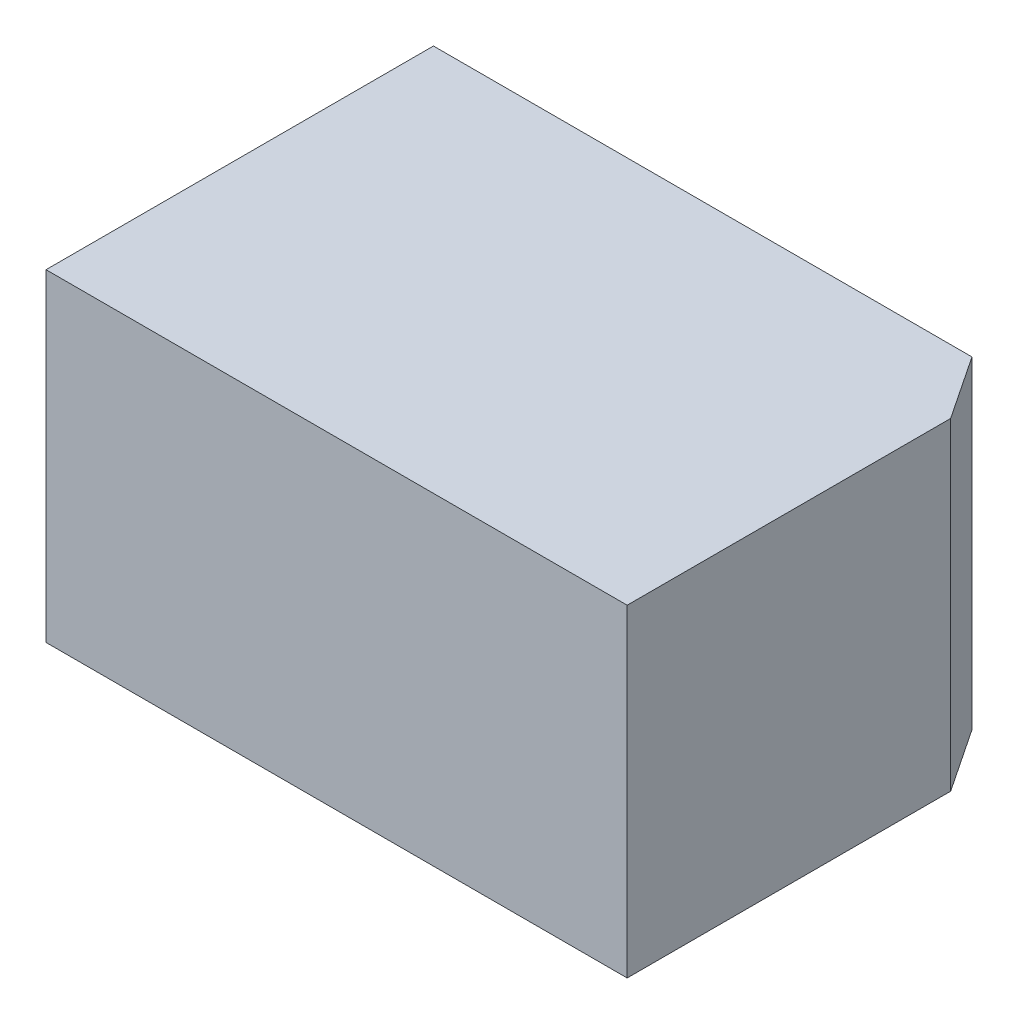
ISO-10303-21;
HEADER;
FILE_DESCRIPTION(('STEP AP214'),'2;1');
FILE_NAME('part.step','',(''),(''),'','','');
FILE_SCHEMA(('AUTOMOTIVE_DESIGN { 1 0 10303 214 1 1 1 1 }'));
ENDSEC;
DATA;
#1=APPLICATION_CONTEXT('core data for automotive mechanical design processes');
#2=APPLICATION_PROTOCOL_DEFINITION('international standard','automotive_design',2000,#1);
#3=PRODUCT_CONTEXT('',#1,'mechanical');
#4=PRODUCT('Part','Part','',(#3));
#5=PRODUCT_RELATED_PRODUCT_CATEGORY('part','',(#4));
#6=PRODUCT_DEFINITION_FORMATION('','',#4);
#7=PRODUCT_DEFINITION_CONTEXT('part definition',#1,'design');
#8=PRODUCT_DEFINITION('design','',#6,#7);
#9=PRODUCT_DEFINITION_SHAPE('','',#8);
#10=(LENGTH_UNIT() NAMED_UNIT(*) SI_UNIT(.MILLI.,.METRE.));
#11=(NAMED_UNIT(*) PLANE_ANGLE_UNIT() SI_UNIT($,.RADIAN.));
#12=(NAMED_UNIT(*) SI_UNIT($,.STERADIAN.) SOLID_ANGLE_UNIT());
#13=UNCERTAINTY_MEASURE_WITH_UNIT(LENGTH_MEASURE(1.E-05),#10,'distance_accuracy_value','');
#14=(GEOMETRIC_REPRESENTATION_CONTEXT(3) GLOBAL_UNCERTAINTY_ASSIGNED_CONTEXT((#13)) GLOBAL_UNIT_ASSIGNED_CONTEXT((#10,
#11,#12)) REPRESENTATION_CONTEXT('',''));
#15=CARTESIAN_POINT('',(0.,0.,0.));
#16=DIRECTION('',(0.,0.,1.));
#17=DIRECTION('',(1.,0.,0.));
#18=AXIS2_PLACEMENT_3D('',#15,#16,#17);
#19=CARTESIAN_POINT('',(-4.5,5.,-3.));
#20=DIRECTION('',(1.,0.,0.));
#21=DIRECTION('',(0.,0.,-1.));
#22=AXIS2_PLACEMENT_3D('',#19,#20,#21);
#23=PLANE('',#22);
#24=DIRECTION('',(0.,0.,1.));
#25=VECTOR('',#24,1.);
#26=CARTESIAN_POINT('',(-4.5,0.,-3.));
#27=LINE('',#26,#25);
#28=CARTESIAN_POINT('',(-4.5,0.,-3.));
#29=VERTEX_POINT('',#28);
#30=CARTESIAN_POINT('',(-4.5,0.,3.));
#31=VERTEX_POINT('',#30);
#32=EDGE_CURVE('E109',#29,#31,#27,.T.);
#33=ORIENTED_EDGE('',*,*,#32,.T.);
#34=DIRECTION('',(0.,-1.,0.));
#35=VECTOR('',#34,1.);
#36=CARTESIAN_POINT('',(-4.5,5.,3.));
#37=LINE('',#36,#35);
#38=CARTESIAN_POINT('',(-4.5,5.,3.));
#39=VERTEX_POINT('',#38);
#40=EDGE_CURVE('E11',#39,#31,#37,.T.);
#41=ORIENTED_EDGE('',*,*,#40,.F.);
#42=DIRECTION('',(0.,0.,1.));
#43=VECTOR('',#42,1.);
#44=CARTESIAN_POINT('',(-4.5,5.,-3.));
#45=LINE('',#44,#43);
#46=CARTESIAN_POINT('',(-4.5,5.,-3.));
#47=VERTEX_POINT('',#46);
#48=EDGE_CURVE('E105',#47,#39,#45,.T.);
#49=ORIENTED_EDGE('',*,*,#48,.F.);
#50=DIRECTION('',(0.,-1.,0.));
#51=VECTOR('',#50,1.);
#52=CARTESIAN_POINT('',(-4.5,5.,-3.));
#53=LINE('',#52,#51);
#54=EDGE_CURVE('E103',#47,#29,#53,.T.);
#55=ORIENTED_EDGE('',*,*,#54,.T.);
#56=EDGE_LOOP('',(#33,#41,#49,#55));
#57=FACE_BOUND('',#56,.T.);
#58=ADVANCED_FACE('F33',(#57),#23,.F.);
#59=CARTESIAN_POINT('',(4.5,5.,3.));
#60=DIRECTION('',(0.,0.,-1.));
#61=DIRECTION('',(-1.,0.,0.));
#62=AXIS2_PLACEMENT_3D('',#59,#60,#61);
#63=PLANE('',#62);
#64=DIRECTION('',(1.,0.,0.));
#65=VECTOR('',#64,1.);
#66=CARTESIAN_POINT('',(4.5,0.,3.));
#67=LINE('',#66,#65);
#68=CARTESIAN_POINT('',(4.5,0.,3.));
#69=VERTEX_POINT('',#68);
#70=EDGE_CURVE('E112',#31,#69,#67,.T.);
#71=ORIENTED_EDGE('',*,*,#70,.T.);
#72=DIRECTION('',(0.,-1.,0.));
#73=VECTOR('',#72,1.);
#74=CARTESIAN_POINT('',(4.5,5.,3.));
#75=LINE('',#74,#73);
#76=CARTESIAN_POINT('',(4.5,5.,3.));
#77=VERTEX_POINT('',#76);
#78=EDGE_CURVE('E40',#77,#69,#75,.T.);
#79=ORIENTED_EDGE('',*,*,#78,.F.);
#80=DIRECTION('',(1.,0.,0.));
#81=VECTOR('',#80,1.);
#82=CARTESIAN_POINT('',(4.5,5.,3.));
#83=LINE('',#82,#81);
#84=EDGE_CURVE('E79',#39,#77,#83,.T.);
#85=ORIENTED_EDGE('',*,*,#84,.F.);
#86=ORIENTED_EDGE('',*,*,#40,.T.);
#87=EDGE_LOOP('',(#71,#79,#85,#86));
#88=FACE_BOUND('',#87,.T.);
#89=ADVANCED_FACE('F149',(#88),#63,.F.);
#90=CARTESIAN_POINT('',(4.5,5.,-3.));
#91=DIRECTION('',(-1.,0.,0.));
#92=DIRECTION('',(0.,0.,1.));
#93=AXIS2_PLACEMENT_3D('',#90,#91,#92);
#94=PLANE('',#93);
#95=DIRECTION('',(0.,0.,-1.));
#96=VECTOR('',#95,1.);
#97=CARTESIAN_POINT('',(4.5,0.,-3.));
#98=LINE('',#97,#96);
#99=CARTESIAN_POINT('',(4.5,0.,-2.00986014973797));
#100=VERTEX_POINT('',#99);
#101=EDGE_CURVE('E99',#69,#100,#98,.T.);
#102=ORIENTED_EDGE('',*,*,#101,.T.);
#103=DIRECTION('',(0.,-1.,0.));
#104=VECTOR('',#103,1.);
#105=CARTESIAN_POINT('',(4.5,5.,-2.00986014973797));
#106=LINE('',#105,#104);
#107=CARTESIAN_POINT('',(4.5,5.,-2.00986014973797));
#108=VERTEX_POINT('',#107);
#109=EDGE_CURVE('E47',#108,#100,#106,.T.);
#110=ORIENTED_EDGE('',*,*,#109,.F.);
#111=DIRECTION('',(0.,0.,-1.));
#112=VECTOR('',#111,1.);
#113=CARTESIAN_POINT('',(4.5,5.,-3.));
#114=LINE('',#113,#112);
#115=EDGE_CURVE('E97',#77,#108,#114,.T.);
#116=ORIENTED_EDGE('',*,*,#115,.F.);
#117=ORIENTED_EDGE('',*,*,#78,.T.);
#118=EDGE_LOOP('',(#102,#110,#116,#117));
#119=FACE_BOUND('',#118,.T.);
#120=ADVANCED_FACE('F95',(#119),#94,.F.);
#121=CARTESIAN_POINT('',(4.5,5.,-3.));
#122=DIRECTION('',(0.,0.,1.));
#123=DIRECTION('',(1.,0.,0.));
#124=AXIS2_PLACEMENT_3D('',#121,#122,#123);
#125=PLANE('',#124);
#126=DIRECTION('',(-1.,0.,0.));
#127=VECTOR('',#126,1.);
#128=CARTESIAN_POINT('',(4.5,5.,-3.));
#129=LINE('',#128,#127);
#130=CARTESIAN_POINT('',(3.83990676649198,5.,-3.));
#131=VERTEX_POINT('',#130);
#132=EDGE_CURVE('E56',#131,#47,#129,.T.);
#133=ORIENTED_EDGE('',*,*,#132,.F.);
#134=DIRECTION('',(0.,-1.,0.));
#135=VECTOR('',#134,1.);
#136=CARTESIAN_POINT('',(3.83990676649198,5.,-3.));
#137=LINE('',#136,#135);
#138=CARTESIAN_POINT('',(3.83990676649198,0.,-3.));
#139=VERTEX_POINT('',#138);
#140=EDGE_CURVE('E88',#131,#139,#137,.T.);
#141=ORIENTED_EDGE('',*,*,#140,.T.);
#142=DIRECTION('',(-1.,0.,0.));
#143=VECTOR('',#142,1.);
#144=CARTESIAN_POINT('',(4.5,0.,-3.));
#145=LINE('',#144,#143);
#146=EDGE_CURVE('E74',#139,#29,#145,.T.);
#147=ORIENTED_EDGE('',*,*,#146,.T.);
#148=ORIENTED_EDGE('',*,*,#54,.F.);
#149=EDGE_LOOP('',(#133,#141,#147,#148));
#150=FACE_BOUND('',#149,.T.);
#151=ADVANCED_FACE('F155',(#150),#125,.F.);
#152=CARTESIAN_POINT('',(0.,5.,0.));
#153=DIRECTION('',(0.,-1.,0.));
#154=DIRECTION('',(0.,0.,-1.));
#155=AXIS2_PLACEMENT_3D('',#152,#153,#154);
#156=PLANE('',#155);
#157=ORIENTED_EDGE('',*,*,#115,.T.);
#158=DIRECTION('',(-0.55470019622523,0.,-0.832050294337843));
#159=VECTOR('',#158,1.);
#160=CARTESIAN_POINT('',(3.83990676649198,5.,-3.));
#161=LINE('',#160,#159);
#162=EDGE_CURVE('E86',#108,#131,#161,.T.);
#163=ORIENTED_EDGE('',*,*,#162,.T.);
#164=ORIENTED_EDGE('',*,*,#132,.T.);
#165=ORIENTED_EDGE('',*,*,#48,.T.);
#166=ORIENTED_EDGE('',*,*,#84,.T.);
#167=EDGE_LOOP('',(#157,#163,#164,#165,#166));
#168=FACE_BOUND('',#167,.T.);
#169=ADVANCED_FACE('F101',(#168),#156,.F.);
#170=CARTESIAN_POINT('',(0.,0.,0.));
#171=DIRECTION('',(0.,-1.,0.));
#172=DIRECTION('',(0.,0.,-1.));
#173=AXIS2_PLACEMENT_3D('',#170,#171,#172);
#174=PLANE('',#173);
#175=DIRECTION('',(-0.55470019622523,0.,-0.832050294337843));
#176=VECTOR('',#175,1.);
#177=CARTESIAN_POINT('',(3.83990676649198,0.,-3.));
#178=LINE('',#177,#176);
#179=EDGE_CURVE('E90',#100,#139,#178,.T.);
#180=ORIENTED_EDGE('',*,*,#179,.F.);
#181=ORIENTED_EDGE('',*,*,#101,.F.);
#182=ORIENTED_EDGE('',*,*,#70,.F.);
#183=ORIENTED_EDGE('',*,*,#32,.F.);
#184=ORIENTED_EDGE('',*,*,#146,.F.);
#185=EDGE_LOOP('',(#180,#181,#182,#183,#184));
#186=FACE_BOUND('',#185,.T.);
#187=CARTESIAN_POINT('',(1.5,0.,0.));
#188=DIRECTION('',(0.,-1.,0.));
#189=DIRECTION('',(0.,0.,-1.));
#190=AXIS2_PLACEMENT_3D('',#187,#188,#189);
#191=CIRCLE('',#190,0.795000000000002);
#192=CARTESIAN_POINT('',(1.5,0.,-0.795000000000002));
#193=VERTEX_POINT('',#192);
#194=EDGE_CURVE('E123',#193,#193,#191,.T.);
#195=ORIENTED_EDGE('',*,*,#194,.F.);
#196=EDGE_LOOP('',(#195));
#197=FACE_BOUND('',#196,.T.);
#198=CARTESIAN_POINT('',(-3.25,0.,1.875));
#199=DIRECTION('',(0.,-1.,0.));
#200=DIRECTION('',(0.,0.,-1.));
#201=AXIS2_PLACEMENT_3D('',#198,#199,#200);
#202=CIRCLE('',#201,0.795000000000001);
#203=CARTESIAN_POINT('',(-3.25,0.,1.08));
#204=VERTEX_POINT('',#203);
#205=EDGE_CURVE('E128',#204,#204,#202,.T.);
#206=ORIENTED_EDGE('',*,*,#205,.F.);
#207=EDGE_LOOP('',(#206));
#208=FACE_BOUND('',#207,.T.);
#209=CARTESIAN_POINT('',(-3.25,0.,-1.875));
#210=DIRECTION('',(0.,-1.,0.));
#211=DIRECTION('',(0.,0.,-1.));
#212=AXIS2_PLACEMENT_3D('',#209,#210,#211);
#213=CIRCLE('',#212,0.795000000000001);
#214=CARTESIAN_POINT('',(-3.25,0.,-2.67));
#215=VERTEX_POINT('',#214);
#216=EDGE_CURVE('E134',#215,#215,#213,.T.);
#217=ORIENTED_EDGE('',*,*,#216,.F.);
#218=EDGE_LOOP('',(#217));
#219=FACE_BOUND('',#218,.T.);
#220=CARTESIAN_POINT('',(-1.5,0.,0.));
#221=DIRECTION('',(0.,-1.,0.));
#222=DIRECTION('',(0.,0.,-1.));
#223=AXIS2_PLACEMENT_3D('',#220,#221,#222);
#224=CIRCLE('',#223,1.25);
#225=CARTESIAN_POINT('',(-1.5,0.,-1.25));
#226=VERTEX_POINT('',#225);
#227=EDGE_CURVE('E140',#226,#226,#224,.T.);
#228=ORIENTED_EDGE('',*,*,#227,.F.);
#229=EDGE_LOOP('',(#228));
#230=FACE_BOUND('',#229,.T.);
#231=ADVANCED_FACE('F118',(#186,#197,#208,#219,#230),#174,.T.);
#232=CARTESIAN_POINT('',(-1.5,4.,0.));
#233=DIRECTION('',(0.,-1.,0.));
#234=DIRECTION('',(0.,0.,-1.));
#235=AXIS2_PLACEMENT_3D('',#232,#233,#234);
#236=CYLINDRICAL_SURFACE('',#235,1.25);
#237=CARTESIAN_POINT('',(-1.5,4.,0.));
#238=DIRECTION('',(0.,-1.,0.));
#239=DIRECTION('',(0.,0.,-1.));
#240=AXIS2_PLACEMENT_3D('',#237,#238,#239);
#241=CIRCLE('',#240,1.25);
#242=CARTESIAN_POINT('',(-1.5,4.,-1.25));
#243=VERTEX_POINT('',#242);
#244=EDGE_CURVE('E113',#243,#243,#241,.T.);
#245=ORIENTED_EDGE('',*,*,#244,.F.);
#246=EDGE_LOOP('',(#245));
#247=FACE_BOUND('',#246,.T.);
#248=ORIENTED_EDGE('',*,*,#227,.T.);
#249=EDGE_LOOP('',(#248));
#250=FACE_BOUND('',#249,.T.);
#251=ADVANCED_FACE('F162',(#247,#250),#236,.F.);
#252=CARTESIAN_POINT('',(-1.5,4.,0.));
#253=DIRECTION('',(0.,-1.,0.));
#254=DIRECTION('',(0.,0.,-1.));
#255=AXIS2_PLACEMENT_3D('',#252,#253,#254);
#256=PLANE('',#255);
#257=ORIENTED_EDGE('',*,*,#244,.T.);
#258=EDGE_LOOP('',(#257));
#259=FACE_BOUND('',#258,.T.);
#260=ADVANCED_FACE('F167',(#259),#256,.T.);
#261=CARTESIAN_POINT('',(-3.25,1.,-1.875));
#262=DIRECTION('',(0.,-1.,0.));
#263=DIRECTION('',(0.,0.,-1.));
#264=AXIS2_PLACEMENT_3D('',#261,#262,#263);
#265=CYLINDRICAL_SURFACE('',#264,0.795000000000001);
#266=CARTESIAN_POINT('',(-3.25,1.,-1.875));
#267=DIRECTION('',(0.,-1.,0.));
#268=DIRECTION('',(0.,0.,-1.));
#269=AXIS2_PLACEMENT_3D('',#266,#267,#268);
#270=CIRCLE('',#269,0.795000000000001);
#271=CARTESIAN_POINT('',(-3.25,1.,-2.67));
#272=VERTEX_POINT('',#271);
#273=EDGE_CURVE('E137',#272,#272,#270,.T.);
#274=ORIENTED_EDGE('',*,*,#273,.F.);
#275=EDGE_LOOP('',(#274));
#276=FACE_BOUND('',#275,.T.);
#277=ORIENTED_EDGE('',*,*,#216,.T.);
#278=EDGE_LOOP('',(#277));
#279=FACE_BOUND('',#278,.T.);
#280=ADVANCED_FACE('F171',(#276,#279),#265,.F.);
#281=CARTESIAN_POINT('',(-3.25,1.,-1.875));
#282=DIRECTION('',(0.,-1.,0.));
#283=DIRECTION('',(0.,0.,-1.));
#284=AXIS2_PLACEMENT_3D('',#281,#282,#283);
#285=PLANE('',#284);
#286=ORIENTED_EDGE('',*,*,#273,.T.);
#287=EDGE_LOOP('',(#286));
#288=FACE_BOUND('',#287,.T.);
#289=ADVANCED_FACE('F175',(#288),#285,.T.);
#290=CARTESIAN_POINT('',(-3.25,1.,1.875));
#291=DIRECTION('',(0.,-1.,0.));
#292=DIRECTION('',(0.,0.,-1.));
#293=AXIS2_PLACEMENT_3D('',#290,#291,#292);
#294=CYLINDRICAL_SURFACE('',#293,0.795000000000001);
#295=CARTESIAN_POINT('',(-3.25,1.,1.875));
#296=DIRECTION('',(0.,-1.,0.));
#297=DIRECTION('',(0.,0.,-1.));
#298=AXIS2_PLACEMENT_3D('',#295,#296,#297);
#299=CIRCLE('',#298,0.795000000000001);
#300=CARTESIAN_POINT('',(-3.25,1.,1.08));
#301=VERTEX_POINT('',#300);
#302=EDGE_CURVE('E131',#301,#301,#299,.T.);
#303=ORIENTED_EDGE('',*,*,#302,.F.);
#304=EDGE_LOOP('',(#303));
#305=FACE_BOUND('',#304,.T.);
#306=ORIENTED_EDGE('',*,*,#205,.T.);
#307=EDGE_LOOP('',(#306));
#308=FACE_BOUND('',#307,.T.);
#309=ADVANCED_FACE('F179',(#305,#308),#294,.F.);
#310=CARTESIAN_POINT('',(-3.25,1.,1.875));
#311=DIRECTION('',(0.,-1.,0.));
#312=DIRECTION('',(0.,0.,-1.));
#313=AXIS2_PLACEMENT_3D('',#310,#311,#312);
#314=PLANE('',#313);
#315=ORIENTED_EDGE('',*,*,#302,.T.);
#316=EDGE_LOOP('',(#315));
#317=FACE_BOUND('',#316,.T.);
#318=ADVANCED_FACE('F183',(#317),#314,.T.);
#319=CARTESIAN_POINT('',(1.5,1.,0.));
#320=DIRECTION('',(0.,-1.,0.));
#321=DIRECTION('',(0.,0.,-1.));
#322=AXIS2_PLACEMENT_3D('',#319,#320,#321);
#323=CYLINDRICAL_SURFACE('',#322,0.795000000000002);
#324=CARTESIAN_POINT('',(1.5,1.,0.));
#325=DIRECTION('',(0.,-1.,0.));
#326=DIRECTION('',(0.,0.,-1.));
#327=AXIS2_PLACEMENT_3D('',#324,#325,#326);
#328=CIRCLE('',#327,0.795000000000002);
#329=CARTESIAN_POINT('',(1.5,1.,-0.795000000000002));
#330=VERTEX_POINT('',#329);
#331=EDGE_CURVE('E125',#330,#330,#328,.T.);
#332=ORIENTED_EDGE('',*,*,#331,.F.);
#333=EDGE_LOOP('',(#332));
#334=FACE_BOUND('',#333,.T.);
#335=ORIENTED_EDGE('',*,*,#194,.T.);
#336=EDGE_LOOP('',(#335));
#337=FACE_BOUND('',#336,.T.);
#338=ADVANCED_FACE('F187',(#334,#337),#323,.F.);
#339=CARTESIAN_POINT('',(1.5,1.,0.));
#340=DIRECTION('',(0.,-1.,0.));
#341=DIRECTION('',(0.,0.,-1.));
#342=AXIS2_PLACEMENT_3D('',#339,#340,#341);
#343=PLANE('',#342);
#344=ORIENTED_EDGE('',*,*,#331,.T.);
#345=EDGE_LOOP('',(#344));
#346=FACE_BOUND('',#345,.T.);
#347=ADVANCED_FACE('F191',(#346),#343,.T.);
#348=CARTESIAN_POINT('',(3.83990676649198,5.,-3.));
#349=DIRECTION('',(-0.832050294337843,0.,0.55470019622523));
#350=DIRECTION('',(0.55470019622523,0.,0.832050294337843));
#351=AXIS2_PLACEMENT_3D('',#348,#349,#350);
#352=PLANE('',#351);
#353=ORIENTED_EDGE('',*,*,#179,.T.);
#354=ORIENTED_EDGE('',*,*,#140,.F.);
#355=ORIENTED_EDGE('',*,*,#162,.F.);
#356=ORIENTED_EDGE('',*,*,#109,.T.);
#357=EDGE_LOOP('',(#353,#354,#355,#356));
#358=FACE_BOUND('',#357,.T.);
#359=ADVANCED_FACE('F87',(#358),#352,.F.);
#360=CLOSED_SHELL('',(#58,#89,#120,#151,#169,#231,#251,#260,#280,#289,#309,#318,#338,#347,#359));
#361=MANIFOLD_SOLID_BREP('B2',#360);
#362=ADVANCED_BREP_SHAPE_REPRESENTATION('',(#18,#361),#14);
#363=SHAPE_DEFINITION_REPRESENTATION(#9,#362);
ENDSEC;
END-ISO-10303-21;
